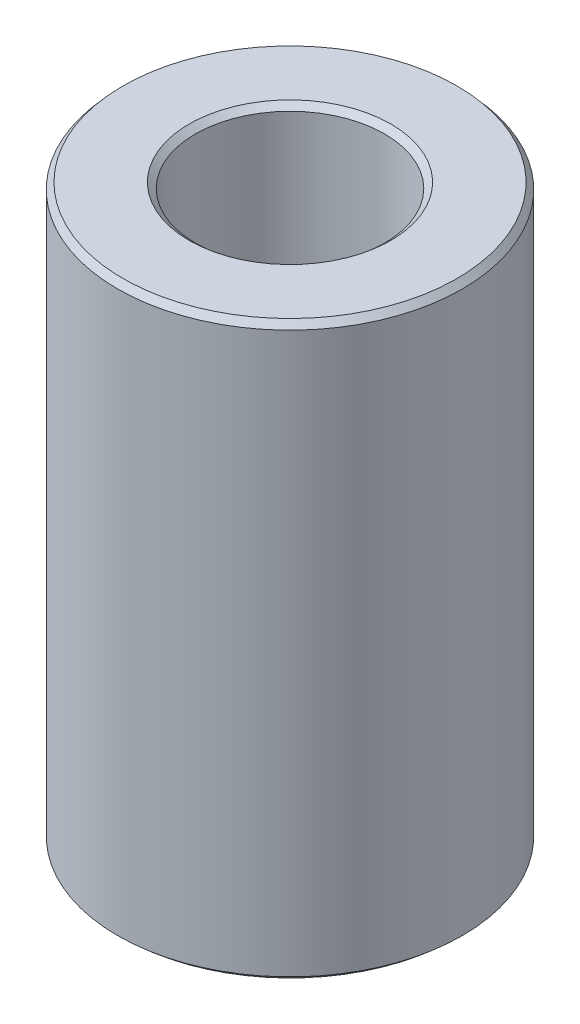
ISO-10303-21;
HEADER;
FILE_DESCRIPTION(('STEP AP214'),'2;1');
FILE_NAME('part.step','',(''),(''),'','','');
FILE_SCHEMA(('AUTOMOTIVE_DESIGN { 1 0 10303 214 1 1 1 1 }'));
ENDSEC;
DATA;
#1=APPLICATION_CONTEXT('core data for automotive mechanical design processes');
#2=APPLICATION_PROTOCOL_DEFINITION('international standard','automotive_design',2000,#1);
#3=PRODUCT_CONTEXT('',#1,'mechanical');
#4=PRODUCT('Part','Part','',(#3));
#5=PRODUCT_RELATED_PRODUCT_CATEGORY('part','',(#4));
#6=PRODUCT_DEFINITION_FORMATION('','',#4);
#7=PRODUCT_DEFINITION_CONTEXT('part definition',#1,'design');
#8=PRODUCT_DEFINITION('design','',#6,#7);
#9=PRODUCT_DEFINITION_SHAPE('','',#8);
#10=(LENGTH_UNIT() NAMED_UNIT(*) SI_UNIT(.MILLI.,.METRE.));
#11=(NAMED_UNIT(*) PLANE_ANGLE_UNIT() SI_UNIT($,.RADIAN.));
#12=(NAMED_UNIT(*) SI_UNIT($,.STERADIAN.) SOLID_ANGLE_UNIT());
#13=UNCERTAINTY_MEASURE_WITH_UNIT(LENGTH_MEASURE(1.E-05),#10,'distance_accuracy_value','');
#14=(GEOMETRIC_REPRESENTATION_CONTEXT(3) GLOBAL_UNCERTAINTY_ASSIGNED_CONTEXT((#13)) GLOBAL_UNIT_ASSIGNED_CONTEXT((#10,
#11,#12)) REPRESENTATION_CONTEXT('',''));
#15=CARTESIAN_POINT('',(0.,0.,0.));
#16=DIRECTION('',(0.,0.,1.));
#17=DIRECTION('',(1.,0.,0.));
#18=AXIS2_PLACEMENT_3D('',#15,#16,#17);
#19=CARTESIAN_POINT('',(0.,41.4638384573055,0.));
#20=DIRECTION('',(0.,-1.,0.));
#21=DIRECTION('',(0.,0.,-1.));
#22=AXIS2_PLACEMENT_3D('',#19,#20,#21);
#23=CYLINDRICAL_SURFACE('',#22,12.5);
#24=CARTESIAN_POINT('',(0.,0.394428065664441,0.));
#25=DIRECTION('',(0.,1.,0.));
#26=DIRECTION('',(0.,0.,1.));
#27=AXIS2_PLACEMENT_3D('',#24,#25,#26);
#28=CIRCLE('',#27,12.5);
#29=CARTESIAN_POINT('',(0.,0.394428065664441,-12.5));
#30=VERTEX_POINT('',#29);
#31=EDGE_CURVE('E10',#30,#30,#28,.T.);
#32=CARTESIAN_POINT('',(0.,41.009299763949,0.));
#33=DIRECTION('',(0.,1.,0.));
#34=DIRECTION('',(0.,0.,1.));
#35=AXIS2_PLACEMENT_3D('',#32,#33,#34);
#36=CIRCLE('',#35,12.5);
#37=CARTESIAN_POINT('',(0.,41.009299763949,-12.5));
#38=VERTEX_POINT('',#37);
#39=EDGE_CURVE('E50',#38,#38,#36,.F.);
#40=CARTESIAN_POINT('',(0.,0.394428065664441,-12.5));
#41=CARTESIAN_POINT('',(0.,0.817499645854906,-12.5));
#42=CARTESIAN_POINT('',(0.,1.24057122604537,-12.5));
#43=CARTESIAN_POINT('',(0.,2.0867143864263,-12.5));
#44=CARTESIAN_POINT('',(0.,2.50978596661676,-12.5));
#45=CARTESIAN_POINT('',(0.,3.35592912699769,-12.5));
#46=CARTESIAN_POINT('',(0.,3.77900070718816,-12.5));
#47=CARTESIAN_POINT('',(0.,4.62514386756909,-12.5));
#48=CARTESIAN_POINT('',(0.,5.04821544775955,-12.5));
#49=CARTESIAN_POINT('',(0.,5.89435860814048,-12.5));
#50=CARTESIAN_POINT('',(0.,6.31743018833095,-12.5));
#51=CARTESIAN_POINT('',(0.,7.16357334871187,-12.5));
#52=CARTESIAN_POINT('',(0.,7.58664492890234,-12.5));
#53=CARTESIAN_POINT('',(0.,8.43278808928327,-12.5));
#54=CARTESIAN_POINT('',(0.,8.85585966947373,-12.5));
#55=CARTESIAN_POINT('',(0.,9.70200282985466,-12.5));
#56=CARTESIAN_POINT('',(0.,10.1250744100451,-12.5));
#57=CARTESIAN_POINT('',(0.,10.9712175704261,-12.5));
#58=CARTESIAN_POINT('',(0.,11.3942891506165,-12.5));
#59=CARTESIAN_POINT('',(0.,12.2404323109974,-12.5));
#60=CARTESIAN_POINT('',(0.,12.6635038911879,-12.5));
#61=CARTESIAN_POINT('',(0.,13.5096470515688,-12.5));
#62=CARTESIAN_POINT('',(0.,13.9327186317593,-12.5));
#63=CARTESIAN_POINT('',(0.,14.7788617921402,-12.5));
#64=CARTESIAN_POINT('',(0.,15.2019333723307,-12.5));
#65=CARTESIAN_POINT('',(0.,16.0480765327116,-12.5));
#66=CARTESIAN_POINT('',(0.,16.4711481129021,-12.5));
#67=CARTESIAN_POINT('',(0.,17.317291273283,-12.5));
#68=CARTESIAN_POINT('',(0.,17.7403628534735,-12.5));
#69=CARTESIAN_POINT('',(0.,18.5865060138544,-12.5));
#70=CARTESIAN_POINT('',(0.,19.0095775940449,-12.5));
#71=CARTESIAN_POINT('',(0.,19.8557207544258,-12.5));
#72=CARTESIAN_POINT('',(0.,20.2787923346163,-12.5));
#73=CARTESIAN_POINT('',(0.,21.1249354949972,-12.5));
#74=CARTESIAN_POINT('',(0.,21.5480070751877,-12.5));
#75=CARTESIAN_POINT('',(0.,22.3941502355686,-12.5));
#76=CARTESIAN_POINT('',(0.,22.8172218157591,-12.5));
#77=CARTESIAN_POINT('',(0.,23.66336497614,-12.5));
#78=CARTESIAN_POINT('',(0.,24.0864365563305,-12.5));
#79=CARTESIAN_POINT('',(0.,24.9325797167114,-12.5));
#80=CARTESIAN_POINT('',(0.,25.3556512969018,-12.5));
#81=CARTESIAN_POINT('',(0.,26.2017944572828,-12.5));
#82=CARTESIAN_POINT('',(0.,26.6248660374732,-12.5));
#83=CARTESIAN_POINT('',(0.,27.4710091978542,-12.5));
#84=CARTESIAN_POINT('',(0.,27.8940807780446,-12.5));
#85=CARTESIAN_POINT('',(0.,28.7402239384256,-12.5));
#86=CARTESIAN_POINT('',(0.,29.163295518616,-12.5));
#87=CARTESIAN_POINT('',(0.,30.009438678997,-12.5));
#88=CARTESIAN_POINT('',(0.,30.4325102591874,-12.5));
#89=CARTESIAN_POINT('',(0.,31.2786534195683,-12.5));
#90=CARTESIAN_POINT('',(0.,31.7017249997588,-12.5));
#91=CARTESIAN_POINT('',(0.,32.5478681601397,-12.5));
#92=CARTESIAN_POINT('',(0.,32.9709397403302,-12.5));
#93=CARTESIAN_POINT('',(0.,33.8170829007111,-12.5));
#94=CARTESIAN_POINT('',(0.,34.2401544809016,-12.5));
#95=CARTESIAN_POINT('',(0.,35.0862976412825,-12.5));
#96=CARTESIAN_POINT('',(0.,35.509369221473,-12.5));
#97=CARTESIAN_POINT('',(0.,36.3555123818539,-12.5));
#98=CARTESIAN_POINT('',(0.,36.7785839620444,-12.5));
#99=CARTESIAN_POINT('',(0.,37.6247271224253,-12.5));
#100=CARTESIAN_POINT('',(0.,38.0477987026158,-12.5));
#101=CARTESIAN_POINT('',(0.,38.8939418629967,-12.5));
#102=CARTESIAN_POINT('',(0.,39.3170134431872,-12.5));
#103=CARTESIAN_POINT('',(0.,40.1631566035681,-12.5));
#104=CARTESIAN_POINT('',(0.,40.5862281837586,-12.5));
#105=CARTESIAN_POINT('',(0.,41.009299763949,-12.5));
#106=B_SPLINE_CURVE_WITH_KNOTS('',3,(#40,#41,#42,#43,#44,#45,#46,#47,#48,#49,#50,#51,#52,#53,
#54,#55,#56,#57,#58,#59,#60,#61,#62,#63,#64,#65,#66,#67,#68,#69,#70,#71,#72,#73,#74,#75,#76,#77,
#78,#79,#80,#81,#82,#83,#84,#85,#86,#87,#88,#89,#90,#91,#92,#93,#94,#95,#96,#97,#98,#99,#100,
#101,#102,#103,#104,#105),.UNSPECIFIED.,.F.,.F.,(4,2,2,2,2,2,2,2,2,2,2,2,2,2,2,2,2,2,2,2,2,2,2,
2,2,2,2,2,2,2,2,2,4),(0.,1.26921474057139,2.53842948114279,3.80764422171418,5.07685896228557,
6.34607370285697,7.61528844342836,8.88450318399975,10.1537179245711,11.4229326651425,
12.6921474057139,13.9613621462853,15.2305768868567,16.4997916274281,17.7690063679995,
19.0382211085709,20.3074358491423,21.5766505897137,22.8458653302851,24.1150800708565,
25.3842948114279,26.6535095519993,27.9227242925707,29.191939033142,30.4611537737134,
31.7303685142848,32.9995832548562,34.2687979954276,35.538012735999,36.8072274765704,
38.0764422171418,39.3456569577132,40.6148716982846),.UNSPECIFIED.);
#107=EDGE_CURVE('BSEAM39',#30,#38,#106,.T.);
#108=ORIENTED_EDGE('',*,*,#31,.T.);
#109=ORIENTED_EDGE('',*,*,#39,.T.);
#110=ORIENTED_EDGE('',*,*,#107,.T.);
#111=ORIENTED_EDGE('',*,*,#107,.F.);
#112=EDGE_LOOP('',(#108,#110,#109,#111));
#113=FACE_BOUND('',#112,.T.);
#114=ADVANCED_FACE('F39',(#113),#23,.T.);
#115=CARTESIAN_POINT('',(0.,41.4638384573055,0.));
#116=DIRECTION('',(0.,1.,0.));
#117=DIRECTION('',(0.,0.,1.));
#118=AXIS2_PLACEMENT_3D('',#115,#116,#117);
#119=PLANE('',#118);
#120=CARTESIAN_POINT('',(0.,41.4638384573055,0.));
#121=DIRECTION('',(0.,1.,0.));
#122=DIRECTION('',(0.,0.,1.));
#123=AXIS2_PLACEMENT_3D('',#120,#121,#122);
#124=CIRCLE('',#123,7.31475959280967);
#125=CARTESIAN_POINT('',(0.,41.4638384573055,7.31475959280967));
#126=VERTEX_POINT('',#125);
#127=EDGE_CURVE('E58',#126,#126,#124,.F.);
#128=ORIENTED_EDGE('',*,*,#127,.T.);
#129=EDGE_LOOP('',(#128));
#130=FACE_BOUND('',#129,.T.);
#131=CARTESIAN_POINT('',(0.,41.4638384573055,0.));
#132=DIRECTION('',(0.,1.,0.));
#133=DIRECTION('',(0.,0.,1.));
#134=AXIS2_PLACEMENT_3D('',#131,#132,#133);
#135=CIRCLE('',#134,12.1055719343356);
#136=CARTESIAN_POINT('',(0.,41.4638384573055,-12.1055719343356));
#137=VERTEX_POINT('',#136);
#138=EDGE_CURVE('E61',#137,#137,#135,.T.);
#139=ORIENTED_EDGE('',*,*,#138,.T.);
#140=EDGE_LOOP('',(#139));
#141=FACE_BOUND('',#140,.T.);
#142=ADVANCED_FACE('F88',(#130,#141),#119,.T.);
#143=CARTESIAN_POINT('',(0.,0.,0.));
#144=DIRECTION('',(0.,1.,0.));
#145=DIRECTION('',(0.,0.,1.));
#146=AXIS2_PLACEMENT_3D('',#143,#144,#145);
#147=PLANE('',#146);
#148=CARTESIAN_POINT('',(0.,0.,0.));
#149=DIRECTION('',(0.,1.,0.));
#150=DIRECTION('',(0.,0.,1.));
#151=AXIS2_PLACEMENT_3D('',#148,#149,#150);
#152=CIRCLE('',#151,7.25464896511762);
#153=CARTESIAN_POINT('',(0.,0.,-7.25464896511762));
#154=VERTEX_POINT('',#153);
#155=EDGE_CURVE('E51',#154,#154,#152,.T.);
#156=ORIENTED_EDGE('',*,*,#155,.T.);
#157=EDGE_LOOP('',(#156));
#158=FACE_BOUND('',#157,.T.);
#159=CARTESIAN_POINT('',(0.,0.,0.));
#160=DIRECTION('',(0.,1.,0.));
#161=DIRECTION('',(0.,0.,1.));
#162=AXIS2_PLACEMENT_3D('',#159,#160,#161);
#163=CIRCLE('',#162,12.0454613066435);
#164=CARTESIAN_POINT('',(0.,0.,12.0454613066435));
#165=VERTEX_POINT('',#164);
#166=EDGE_CURVE('E54',#165,#165,#163,.F.);
#167=ORIENTED_EDGE('',*,*,#166,.T.);
#168=EDGE_LOOP('',(#167));
#169=FACE_BOUND('',#168,.T.);
#170=ADVANCED_FACE('F83',(#158,#169),#147,.F.);
#171=CARTESIAN_POINT('',(0.,41.4638384573055,0.));
#172=DIRECTION('',(0.,-1.,0.));
#173=DIRECTION('',(0.,0.,-1.));
#174=AXIS2_PLACEMENT_3D('',#171,#172,#173);
#175=CYLINDRICAL_SURFACE('',#174,6.8602208994532);
#176=CARTESIAN_POINT('',(0.,41.069410391641,0.));
#177=DIRECTION('',(0.,1.,0.));
#178=DIRECTION('',(0.,0.,1.));
#179=AXIS2_PLACEMENT_3D('',#176,#177,#178);
#180=CIRCLE('',#179,6.8602208994532);
#181=CARTESIAN_POINT('',(0.,41.069410391641,-6.8602208994532));
#182=VERTEX_POINT('',#181);
#183=EDGE_CURVE('E67',#182,#182,#180,.T.);
#184=CARTESIAN_POINT('',(0.,0.454538693356432,0.));
#185=DIRECTION('',(0.,1.,0.));
#186=DIRECTION('',(0.,0.,1.));
#187=AXIS2_PLACEMENT_3D('',#184,#185,#186);
#188=CIRCLE('',#187,6.8602208994532);
#189=CARTESIAN_POINT('',(0.,0.454538693356425,-6.8602208994532));
#190=VERTEX_POINT('',#189);
#191=EDGE_CURVE('E69',#190,#190,#188,.F.);
#192=CARTESIAN_POINT('',(0.,41.069410391641,-6.8602208994532));
#193=CARTESIAN_POINT('',(0.,40.6463388114505,-6.8602208994532));
#194=CARTESIAN_POINT('',(0.,40.2232672312601,-6.8602208994532));
#195=CARTESIAN_POINT('',(0.,39.3771240708792,-6.8602208994532));
#196=CARTESIAN_POINT('',(0.,38.9540524906887,-6.8602208994532));
#197=CARTESIAN_POINT('',(0.,38.1079093303078,-6.8602208994532));
#198=CARTESIAN_POINT('',(0.,37.6848377501173,-6.8602208994532));
#199=CARTESIAN_POINT('',(0.,36.8386945897364,-6.8602208994532));
#200=CARTESIAN_POINT('',(0.,36.4156230095459,-6.8602208994532));
#201=CARTESIAN_POINT('',(0.,35.569479849165,-6.8602208994532));
#202=CARTESIAN_POINT('',(0.,35.1464082689745,-6.8602208994532));
#203=CARTESIAN_POINT('',(0.,34.3002651085936,-6.8602208994532));
#204=CARTESIAN_POINT('',(0.,33.8771935284031,-6.8602208994532));
#205=CARTESIAN_POINT('',(0.,33.0310503680222,-6.8602208994532));
#206=CARTESIAN_POINT('',(0.,32.6079787878317,-6.8602208994532));
#207=CARTESIAN_POINT('',(0.,31.7618356274508,-6.8602208994532));
#208=CARTESIAN_POINT('',(0.,31.3387640472603,-6.8602208994532));
#209=CARTESIAN_POINT('',(0.,30.4926208868794,-6.8602208994532));
#210=CARTESIAN_POINT('',(0.,30.0695493066889,-6.8602208994532));
#211=CARTESIAN_POINT('',(0.,29.223406146308,-6.8602208994532));
#212=CARTESIAN_POINT('',(0.,28.8003345661175,-6.8602208994532));
#213=CARTESIAN_POINT('',(0.,27.9541914057366,-6.8602208994532));
#214=CARTESIAN_POINT('',(0.,27.5311198255461,-6.8602208994532));
#215=CARTESIAN_POINT('',(0.,26.6849766651652,-6.8602208994532));
#216=CARTESIAN_POINT('',(0.,26.2619050849748,-6.8602208994532));
#217=CARTESIAN_POINT('',(0.,25.4157619245938,-6.8602208994532));
#218=CARTESIAN_POINT('',(0.,24.9926903444034,-6.8602208994532));
#219=CARTESIAN_POINT('',(0.,24.1465471840224,-6.8602208994532));
#220=CARTESIAN_POINT('',(0.,23.723475603832,-6.8602208994532));
#221=CARTESIAN_POINT('',(0.,22.877332443451,-6.8602208994532));
#222=CARTESIAN_POINT('',(0.,22.4542608632606,-6.8602208994532));
#223=CARTESIAN_POINT('',(0.,21.6081177028796,-6.8602208994532));
#224=CARTESIAN_POINT('',(0.,21.1850461226892,-6.8602208994532));
#225=CARTESIAN_POINT('',(0.,20.3389029623083,-6.8602208994532));
#226=CARTESIAN_POINT('',(0.,19.9158313821178,-6.8602208994532));
#227=CARTESIAN_POINT('',(0.,19.0696882217369,-6.8602208994532));
#228=CARTESIAN_POINT('',(0.,18.6466166415464,-6.8602208994532));
#229=CARTESIAN_POINT('',(0.,17.8004734811655,-6.8602208994532));
#230=CARTESIAN_POINT('',(0.,17.377401900975,-6.8602208994532));
#231=CARTESIAN_POINT('',(0.,16.5312587405941,-6.8602208994532));
#232=CARTESIAN_POINT('',(0.,16.1081871604036,-6.8602208994532));
#233=CARTESIAN_POINT('',(0.,15.2620440000227,-6.8602208994532));
#234=CARTESIAN_POINT('',(0.,14.8389724198322,-6.8602208994532));
#235=CARTESIAN_POINT('',(0.,13.9928292594513,-6.8602208994532));
#236=CARTESIAN_POINT('',(0.,13.5697576792608,-6.8602208994532));
#237=CARTESIAN_POINT('',(0.,12.7236145188799,-6.8602208994532));
#238=CARTESIAN_POINT('',(0.,12.3005429386894,-6.8602208994532));
#239=CARTESIAN_POINT('',(0.,11.4543997783085,-6.8602208994532));
#240=CARTESIAN_POINT('',(0.,11.031328198118,-6.8602208994532));
#241=CARTESIAN_POINT('',(0.,10.1851850377371,-6.8602208994532));
#242=CARTESIAN_POINT('',(0.,9.76211345754664,-6.8602208994532));
#243=CARTESIAN_POINT('',(0.,8.91597029716572,-6.8602208994532));
#244=CARTESIAN_POINT('',(0.,8.49289871697525,-6.8602208994532));
#245=CARTESIAN_POINT('',(0.,7.64675555659432,-6.8602208994532));
#246=CARTESIAN_POINT('',(0.,7.22368397640386,-6.8602208994532));
#247=CARTESIAN_POINT('',(0.,6.37754081602293,-6.8602208994532));
#248=CARTESIAN_POINT('',(0.,5.95446923583246,-6.8602208994532));
#249=CARTESIAN_POINT('',(0.,5.10832607545153,-6.8602208994532));
#250=CARTESIAN_POINT('',(0.,4.68525449526107,-6.8602208994532));
#251=CARTESIAN_POINT('',(0.,3.83911133488014,-6.8602208994532));
#252=CARTESIAN_POINT('',(0.,3.41603975468968,-6.8602208994532));
#253=CARTESIAN_POINT('',(0.,2.56989659430875,-6.8602208994532));
#254=CARTESIAN_POINT('',(0.,2.14682501411828,-6.8602208994532));
#255=CARTESIAN_POINT('',(0.,1.30068185373735,-6.8602208994532));
#256=CARTESIAN_POINT('',(0.,0.87761027354689,-6.8602208994532));
#257=CARTESIAN_POINT('',(0.,0.454538693356425,-6.8602208994532));
#258=B_SPLINE_CURVE_WITH_KNOTS('',3,(#192,#193,#194,#195,#196,#197,#198,#199,#200,#201,#202,
#203,#204,#205,#206,#207,#208,#209,#210,#211,#212,#213,#214,#215,#216,#217,#218,#219,#220,#221,
#222,#223,#224,#225,#226,#227,#228,#229,#230,#231,#232,#233,#234,#235,#236,#237,#238,#239,#240,
#241,#242,#243,#244,#245,#246,#247,#248,#249,#250,#251,#252,#253,#254,#255,#256,#257),
.UNSPECIFIED.,.F.,.F.,(4,2,2,2,2,2,2,2,2,2,2,2,2,2,2,2,2,2,2,2,2,2,2,2,2,2,2,2,2,2,2,2,4),(0.,
1.26921474057139,2.53842948114278,3.80764422171417,5.07685896228557,6.34607370285696,
7.61528844342835,8.88450318399975,10.1537179245711,11.4229326651425,12.6921474057139,
13.9613621462853,15.2305768868567,16.4997916274281,17.7690063679995,19.0382211085709,
20.3074358491423,21.5766505897137,22.8458653302851,24.1150800708565,25.3842948114279,
26.6535095519993,27.9227242925706,29.191939033142,30.4611537737134,31.7303685142848,
32.9995832548562,34.2687979954276,35.538012735999,36.8072274765704,38.0764422171418,
39.3456569577132,40.6148716982846),.UNSPECIFIED.);
#259=EDGE_CURVE('BSEAM71',#182,#190,#258,.T.);
#260=ORIENTED_EDGE('',*,*,#183,.T.);
#261=ORIENTED_EDGE('',*,*,#191,.T.);
#262=ORIENTED_EDGE('',*,*,#259,.T.);
#263=ORIENTED_EDGE('',*,*,#259,.F.);
#264=EDGE_LOOP('',(#260,#262,#261,#263));
#265=FACE_BOUND('',#264,.T.);
#266=ADVANCED_FACE('F71',(#265),#175,.F.);
#267=CARTESIAN_POINT('',(0.,41.069410391641,0.));
#268=DIRECTION('',(0.,1.,0.));
#269=DIRECTION('',(0.,0.,1.));
#270=AXIS2_PLACEMENT_3D('',#267,#268,#269);
#271=CONICAL_SURFACE('',#270,6.8602208994532,0.85608465123076);
#272=ORIENTED_EDGE('',*,*,#127,.F.);
#273=EDGE_LOOP('',(#272));
#274=FACE_BOUND('',#273,.T.);
#275=ORIENTED_EDGE('',*,*,#183,.F.);
#276=EDGE_LOOP('',(#275));
#277=FACE_BOUND('',#276,.T.);
#278=ADVANCED_FACE('F77',(#274,#277),#271,.F.);
#279=CARTESIAN_POINT('',(0.,0.,0.));
#280=DIRECTION('',(0.,-1.,0.));
#281=DIRECTION('',(0.,0.,-1.));
#282=AXIS2_PLACEMENT_3D('',#279,#280,#281);
#283=CONICAL_SURFACE('',#282,7.25464896511762,0.714711675564134);
#284=CARTESIAN_POINT('',(0.,0.454538693356432,-6.8602208994532));
#285=CARTESIAN_POINT('',(0.,0.449803915300636,-6.8643295251372));
#286=CARTESIAN_POINT('',(0.,0.44506913724484,-6.86843815082121));
#287=CARTESIAN_POINT('',(0.,0.435599581133247,-6.87665540218922));
#288=CARTESIAN_POINT('',(0.,0.430864803077451,-6.88076402787322));
#289=CARTESIAN_POINT('',(0.,0.421395246965859,-6.88898127924123));
#290=CARTESIAN_POINT('',(0.,0.416660468910063,-6.89308990492523));
#291=CARTESIAN_POINT('',(0.,0.40719091279847,-6.90130715629324));
#292=CARTESIAN_POINT('',(0.,0.402456134742674,-6.90541578197725));
#293=CARTESIAN_POINT('',(0.,0.392986578631082,-6.91363303334526));
#294=CARTESIAN_POINT('',(0.,0.388251800575286,-6.91774165902926));
#295=CARTESIAN_POINT('',(0.,0.378782244463693,-6.92595891039727));
#296=CARTESIAN_POINT('',(0.,0.374047466407897,-6.93006753608127));
#297=CARTESIAN_POINT('',(0.,0.364577910296305,-6.93828478744928));
#298=CARTESIAN_POINT('',(0.,0.359843132240509,-6.94239341313328));
#299=CARTESIAN_POINT('',(0.,0.350373576128916,-6.95061066450129));
#300=CARTESIAN_POINT('',(0.,0.34563879807312,-6.9547192901853));
#301=CARTESIAN_POINT('',(0.,0.336169241961528,-6.96293654155331));
#302=CARTESIAN_POINT('',(0.,0.331434463905732,-6.96704516723731));
#303=CARTESIAN_POINT('',(0.,0.321964907794139,-6.97526241860532));
#304=CARTESIAN_POINT('',(0.,0.317230129738343,-6.97937104428932));
#305=CARTESIAN_POINT('',(0.,0.307760573626751,-6.98758829565733));
#306=CARTESIAN_POINT('',(0.,0.303025795570955,-6.99169692134134));
#307=CARTESIAN_POINT('',(0.,0.293556239459362,-6.99991417270935));
#308=CARTESIAN_POINT('',(0.,0.288821461403566,-7.00402279839335));
#309=CARTESIAN_POINT('',(0.,0.279351905291974,-7.01224004976136));
#310=CARTESIAN_POINT('',(0.,0.274617127236178,-7.01634867544536));
#311=CARTESIAN_POINT('',(0.,0.265147571124585,-7.02456592681337));
#312=CARTESIAN_POINT('',(0.,0.260412793068789,-7.02867455249738));
#313=CARTESIAN_POINT('',(0.,0.250943236957197,-7.03689180386539));
#314=CARTESIAN_POINT('',(0.,0.246208458901401,-7.04100042954939));
#315=CARTESIAN_POINT('',(0.,0.236738902789808,-7.0492176809174));
#316=CARTESIAN_POINT('',(0.,0.232004124734012,-7.0533263066014));
#317=CARTESIAN_POINT('',(0.,0.22253456862242,-7.06154355796941));
#318=CARTESIAN_POINT('',(0.,0.217799790566624,-7.06565218365342));
#319=CARTESIAN_POINT('',(0.,0.208330234455031,-7.07386943502143));
#320=CARTESIAN_POINT('',(0.,0.203595456399235,-7.07797806070543));
#321=CARTESIAN_POINT('',(0.,0.194125900287643,-7.08619531207344));
#322=CARTESIAN_POINT('',(0.,0.189391122231847,-7.09030393775744));
#323=CARTESIAN_POINT('',(0.,0.179921566120254,-7.09852118912545));
#324=CARTESIAN_POINT('',(0.,0.175186788064458,-7.10262981480946));
#325=CARTESIAN_POINT('',(0.,0.165717231952866,-7.11084706617746));
#326=CARTESIAN_POINT('',(0.,0.16098245389707,-7.11495569186147));
#327=CARTESIAN_POINT('',(0.,0.151512897785477,-7.12317294322948));
#328=CARTESIAN_POINT('',(0.,0.146778119729681,-7.12728156891348));
#329=CARTESIAN_POINT('',(0.,0.137308563618089,-7.13549882028149));
#330=CARTESIAN_POINT('',(0.,0.132573785562293,-7.1396074459655));
#331=CARTESIAN_POINT('',(0.,0.1231042294507,-7.1478246973335));
#332=CARTESIAN_POINT('',(0.,0.118369451394904,-7.15193332301751));
#333=CARTESIAN_POINT('',(0.,0.108899895283312,-7.16015057438552));
#334=CARTESIAN_POINT('',(0.,0.104165117227516,-7.16425920006952));
#335=CARTESIAN_POINT('',(0.,0.0946955611159234,-7.17247645143753));
#336=CARTESIAN_POINT('',(0.,0.0899607830601272,-7.17658507712154));
#337=CARTESIAN_POINT('',(0.,0.0804912269485348,-7.18480232848954));
#338=CARTESIAN_POINT('',(0.,0.0757564488927387,-7.18891095417355));
#339=CARTESIAN_POINT('',(0.,0.0662868927811463,-7.19712820554156));
#340=CARTESIAN_POINT('',(0.,0.0615521147253502,-7.20123683122556));
#341=CARTESIAN_POINT('',(0.,0.0520825586137578,-7.20945408259357));
#342=CARTESIAN_POINT('',(0.,0.0473477805579617,-7.21356270827757));
#343=CARTESIAN_POINT('',(0.,0.0378782244463693,-7.22177995964558));
#344=CARTESIAN_POINT('',(0.,0.0331434463905732,-7.22588858532959));
#345=CARTESIAN_POINT('',(0.,0.0236738902789808,-7.2341058366976));
#346=CARTESIAN_POINT('',(0.,0.0189391122231847,-7.2382144623816));
#347=CARTESIAN_POINT('',(0.,0.00946955611159234,-7.24643171374961));
#348=CARTESIAN_POINT('',(0.,0.00473477805579618,-7.25054033943361));
#349=CARTESIAN_POINT('',(0.,0.,-7.25464896511762));
#350=B_SPLINE_CURVE_WITH_KNOTS('',3,(#284,#285,#286,#287,#288,#289,#290,#291,#292,#293,#294,
#295,#296,#297,#298,#299,#300,#301,#302,#303,#304,#305,#306,#307,#308,#309,#310,#311,#312,#313,
#314,#315,#316,#317,#318,#319,#320,#321,#322,#323,#324,#325,#326,#327,#328,#329,#330,#331,#332,
#333,#334,#335,#336,#337,#338,#339,#340,#341,#342,#343,#344,#345,#346,#347,#348,#349),
.UNSPECIFIED.,.F.,.F.,(4,2,2,2,2,2,2,2,2,2,2,2,2,2,2,2,2,2,2,2,2,2,2,2,2,2,2,2,2,2,2,2,4),(0.,
0.0188066571787807,0.0376133143575615,0.0564199715363422,0.0752266287151229,0.0940332858939036,
0.112839943072684,0.131646600251465,0.150453257430246,0.169259914609027,0.188066571787807,
0.206873228966588,0.225679886145369,0.244486543324149,0.26329320050293,0.282099857681711,
0.300906514860492,0.319713172039272,0.338519829218053,0.357326486396834,0.376133143575615,
0.394939800754395,0.413746457933176,0.432553115111957,0.451359772290738,0.470166429469518,
0.488973086648299,0.50777974382708,0.526586401005861,0.545393058184641,0.564199715363422,
0.583006372542203,0.601813029720983),.UNSPECIFIED.);
#351=EDGE_CURVE('BSEAM73',#190,#154,#350,.T.);
#352=ORIENTED_EDGE('',*,*,#191,.F.);
#353=ORIENTED_EDGE('',*,*,#155,.F.);
#354=ORIENTED_EDGE('',*,*,#351,.T.);
#355=ORIENTED_EDGE('',*,*,#351,.F.);
#356=EDGE_LOOP('',(#352,#354,#353,#355));
#357=FACE_BOUND('',#356,.T.);
#358=ADVANCED_FACE('F73',(#357),#283,.F.);
#359=CARTESIAN_POINT('',(0.,0.394428065664441,0.));
#360=DIRECTION('',(0.,1.,0.));
#361=DIRECTION('',(0.,0.,1.));
#362=AXIS2_PLACEMENT_3D('',#359,#360,#361);
#363=CONICAL_SURFACE('',#362,12.5,0.856084651230773);
#364=ORIENTED_EDGE('',*,*,#166,.F.);
#365=EDGE_LOOP('',(#364));
#366=FACE_BOUND('',#365,.T.);
#367=ORIENTED_EDGE('',*,*,#31,.F.);
#368=EDGE_LOOP('',(#367));
#369=FACE_BOUND('',#368,.T.);
#370=ADVANCED_FACE('F76',(#366,#369),#363,.T.);
#371=CARTESIAN_POINT('',(0.,41.4638384573055,0.));
#372=DIRECTION('',(0.,-1.,0.));
#373=DIRECTION('',(0.,0.,-1.));
#374=AXIS2_PLACEMENT_3D('',#371,#372,#373);
#375=CONICAL_SURFACE('',#374,12.1055719343356,0.714711675564131);
#376=CARTESIAN_POINT('',(0.,41.009299763949,-12.5));
#377=CARTESIAN_POINT('',(0.,41.0140345420048,-12.495891374316));
#378=CARTESIAN_POINT('',(0.,41.0187693200606,-12.491782748632));
#379=CARTESIAN_POINT('',(0.,41.0282388761722,-12.483565497264));
#380=CARTESIAN_POINT('',(0.,41.032973654228,-12.47945687158));
#381=CARTESIAN_POINT('',(0.,41.0424432103396,-12.471239620212));
#382=CARTESIAN_POINT('',(0.,41.0471779883954,-12.467130994528));
#383=CARTESIAN_POINT('',(0.,41.056647544507,-12.45891374316));
#384=CARTESIAN_POINT('',(0.,41.0613823225628,-12.454805117476));
#385=CARTESIAN_POINT('',(0.,41.0708518786744,-12.4465878661079));
#386=CARTESIAN_POINT('',(0.,41.0755866567302,-12.4424792404239));
#387=CARTESIAN_POINT('',(0.,41.0850562128418,-12.4342619890559));
#388=CARTESIAN_POINT('',(0.,41.0897909908976,-12.4301533633719));
#389=CARTESIAN_POINT('',(0.,41.0992605470092,-12.4219361120039));
#390=CARTESIAN_POINT('',(0.,41.103995325065,-12.4178274863199));
#391=CARTESIAN_POINT('',(0.,41.1134648811765,-12.4096102349519));
#392=CARTESIAN_POINT('',(0.,41.1181996592323,-12.4055016092679));
#393=CARTESIAN_POINT('',(0.,41.1276692153439,-12.3972843578999));
#394=CARTESIAN_POINT('',(0.,41.1324039933997,-12.3931757322159));
#395=CARTESIAN_POINT('',(0.,41.1418735495113,-12.3849584808479));
#396=CARTESIAN_POINT('',(0.,41.1466083275671,-12.3808498551639));
#397=CARTESIAN_POINT('',(0.,41.1560778836787,-12.3726326037959));
#398=CARTESIAN_POINT('',(0.,41.1608126617345,-12.3685239781119));
#399=CARTESIAN_POINT('',(0.,41.1702822178461,-12.3603067267439));
#400=CARTESIAN_POINT('',(0.,41.1750169959019,-12.3561981010599));
#401=CARTESIAN_POINT('',(0.,41.1844865520135,-12.3479808496918));
#402=CARTESIAN_POINT('',(0.,41.1892213300693,-12.3438722240078));
#403=CARTESIAN_POINT('',(0.,41.1986908861809,-12.3356549726398));
#404=CARTESIAN_POINT('',(0.,41.2034256642367,-12.3315463469558));
#405=CARTESIAN_POINT('',(0.,41.2128952203483,-12.3233290955878));
#406=CARTESIAN_POINT('',(0.,41.2176299984041,-12.3192204699038));
#407=CARTESIAN_POINT('',(0.,41.2270995545157,-12.3110032185358));
#408=CARTESIAN_POINT('',(0.,41.2318343325715,-12.3068945928518));
#409=CARTESIAN_POINT('',(0.,41.241303888683,-12.2986773414838));
#410=CARTESIAN_POINT('',(0.,41.2460386667388,-12.2945687157998));
#411=CARTESIAN_POINT('',(0.,41.2555082228504,-12.2863514644318));
#412=CARTESIAN_POINT('',(0.,41.2602430009062,-12.2822428387478));
#413=CARTESIAN_POINT('',(0.,41.2697125570178,-12.2740255873798));
#414=CARTESIAN_POINT('',(0.,41.2744473350736,-12.2699169616958));
#415=CARTESIAN_POINT('',(0.,41.2839168911852,-12.2616997103278));
#416=CARTESIAN_POINT('',(0.,41.288651669241,-12.2575910846438));
#417=CARTESIAN_POINT('',(0.,41.2981212253526,-12.2493738332757));
#418=CARTESIAN_POINT('',(0.,41.3028560034084,-12.2452652075917));
#419=CARTESIAN_POINT('',(0.,41.31232555952,-12.2370479562237));
#420=CARTESIAN_POINT('',(0.,41.3170603375758,-12.2329393305397));
#421=CARTESIAN_POINT('',(0.,41.3265298936874,-12.2247220791717));
#422=CARTESIAN_POINT('',(0.,41.3312646717432,-12.2206134534877));
#423=CARTESIAN_POINT('',(0.,41.3407342278548,-12.2123962021197));
#424=CARTESIAN_POINT('',(0.,41.3454690059106,-12.2082875764357));
#425=CARTESIAN_POINT('',(0.,41.3549385620221,-12.2000703250677));
#426=CARTESIAN_POINT('',(0.,41.3596733400779,-12.1959616993837));
#427=CARTESIAN_POINT('',(0.,41.3691428961895,-12.1877444480157));
#428=CARTESIAN_POINT('',(0.,41.3738776742453,-12.1836358223317));
#429=CARTESIAN_POINT('',(0.,41.3833472303569,-12.1754185709637));
#430=CARTESIAN_POINT('',(0.,41.3880820084127,-12.1713099452797));
#431=CARTESIAN_POINT('',(0.,41.3975515645243,-12.1630926939117));
#432=CARTESIAN_POINT('',(0.,41.4022863425801,-12.1589840682276));
#433=CARTESIAN_POINT('',(0.,41.4117558986917,-12.1507668168596));
#434=CARTESIAN_POINT('',(0.,41.4164906767475,-12.1466581911756));
#435=CARTESIAN_POINT('',(0.,41.4259602328591,-12.1384409398076));
#436=CARTESIAN_POINT('',(0.,41.4306950109149,-12.1343323141236));
#437=CARTESIAN_POINT('',(0.,41.4401645670265,-12.1261150627556));
#438=CARTESIAN_POINT('',(0.,41.4448993450823,-12.1220064370716));
#439=CARTESIAN_POINT('',(0.,41.4543689011939,-12.1137891857036));
#440=CARTESIAN_POINT('',(0.,41.4591036792497,-12.1096805600196));
#441=CARTESIAN_POINT('',(0.,41.4638384573055,-12.1055719343356));
#442=B_SPLINE_CURVE_WITH_KNOTS('',3,(#376,#377,#378,#379,#380,#381,#382,#383,#384,#385,#386,
#387,#388,#389,#390,#391,#392,#393,#394,#395,#396,#397,#398,#399,#400,#401,#402,#403,#404,#405,
#406,#407,#408,#409,#410,#411,#412,#413,#414,#415,#416,#417,#418,#419,#420,#421,#422,#423,#424,
#425,#426,#427,#428,#429,#430,#431,#432,#433,#434,#435,#436,#437,#438,#439,#440,#441),
.UNSPECIFIED.,.F.,.F.,(4,2,2,2,2,2,2,2,2,2,2,2,2,2,2,2,2,2,2,2,2,2,2,2,2,2,2,2,2,2,2,2,4),(0.,
0.0188066571787781,0.0376133143575562,0.0564199715363396,0.0752266287151177,0.0940332858938999,
0.112839943072678,0.131646600251461,0.150453257430239,0.169259914609023,0.188066571787801,
0.206873228966584,0.225679886145361,0.244486543324145,0.263293200502923,0.282099857681706,
0.300906514860484,0.319713172039262,0.338519829218044,0.357326486396823,0.376133143575606,
0.394939800754384,0.413746457933167,0.432553115111945,0.451359772290729,0.470166429469506,
0.488973086648289,0.507779743827067,0.52658640100585,0.545393058184628,0.564199715363412,
0.583006372542189,0.601813029720972),.UNSPECIFIED.);
#443=EDGE_CURVE('BSEAM45',#38,#137,#442,.T.);
#444=ORIENTED_EDGE('',*,*,#39,.F.);
#445=ORIENTED_EDGE('',*,*,#138,.F.);
#446=ORIENTED_EDGE('',*,*,#443,.T.);
#447=ORIENTED_EDGE('',*,*,#443,.F.);
#448=EDGE_LOOP('',(#444,#446,#445,#447));
#449=FACE_BOUND('',#448,.T.);
#450=ADVANCED_FACE('F45',(#449),#375,.T.);
#451=CLOSED_SHELL('',(#114,#142,#170,#266,#278,#358,#370,#450));
#452=MANIFOLD_SOLID_BREP('B2',#451);
#453=ADVANCED_BREP_SHAPE_REPRESENTATION('',(#18,#452),#14);
#454=SHAPE_DEFINITION_REPRESENTATION(#9,#453);
ENDSEC;
END-ISO-10303-21;
